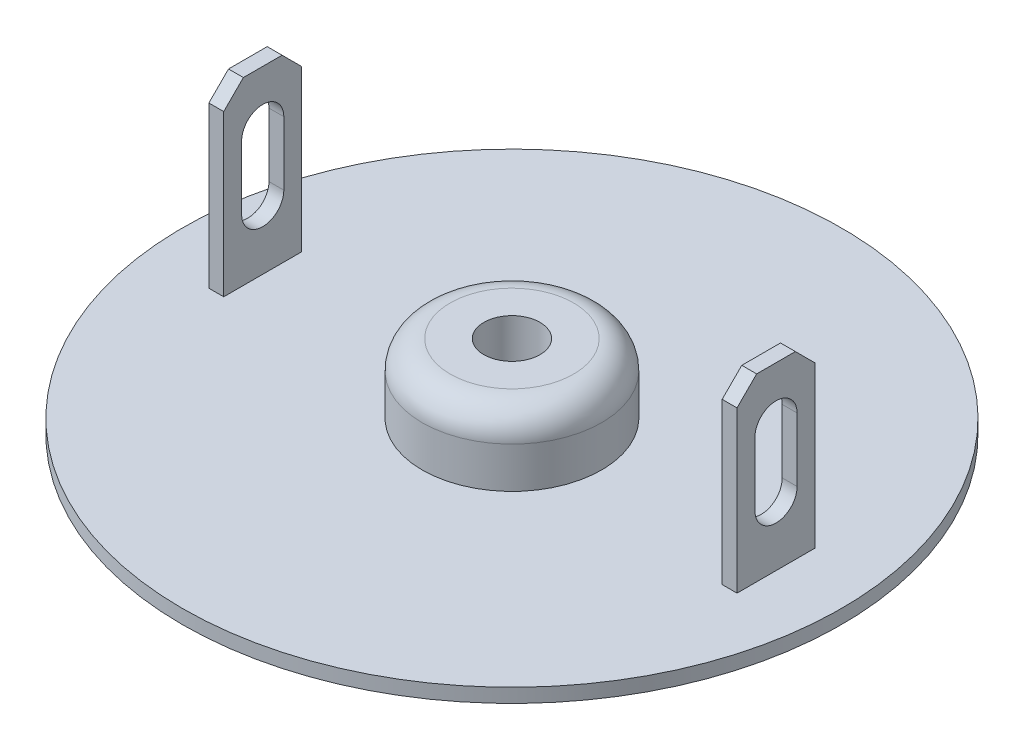
ISO-10303-21;
HEADER;
FILE_DESCRIPTION(('STEP AP214'),'2;1');
FILE_NAME('part.step','',(''),(''),'','','');
FILE_SCHEMA(('AUTOMOTIVE_DESIGN { 1 0 10303 214 1 1 1 1 }'));
ENDSEC;
DATA;
#1=APPLICATION_CONTEXT('core data for automotive mechanical design processes');
#2=APPLICATION_PROTOCOL_DEFINITION('international standard','automotive_design',2000,#1);
#3=PRODUCT_CONTEXT('',#1,'mechanical');
#4=PRODUCT('Part','Part','',(#3));
#5=PRODUCT_RELATED_PRODUCT_CATEGORY('part','',(#4));
#6=PRODUCT_DEFINITION_FORMATION('','',#4);
#7=PRODUCT_DEFINITION_CONTEXT('part definition',#1,'design');
#8=PRODUCT_DEFINITION('design','',#6,#7);
#9=PRODUCT_DEFINITION_SHAPE('','',#8);
#10=(LENGTH_UNIT() NAMED_UNIT(*) SI_UNIT(.MILLI.,.METRE.));
#11=(NAMED_UNIT(*) PLANE_ANGLE_UNIT() SI_UNIT($,.RADIAN.));
#12=(NAMED_UNIT(*) SI_UNIT($,.STERADIAN.) SOLID_ANGLE_UNIT());
#13=UNCERTAINTY_MEASURE_WITH_UNIT(LENGTH_MEASURE(1.E-05),#10,'distance_accuracy_value','');
#14=(GEOMETRIC_REPRESENTATION_CONTEXT(3) GLOBAL_UNCERTAINTY_ASSIGNED_CONTEXT((#13)) GLOBAL_UNIT_ASSIGNED_CONTEXT((#10,
#11,#12)) REPRESENTATION_CONTEXT('',''));
#15=CARTESIAN_POINT('',(0.,0.,0.));
#16=DIRECTION('',(0.,0.,1.));
#17=DIRECTION('',(1.,0.,0.));
#18=AXIS2_PLACEMENT_3D('',#15,#16,#17);
#19=CARTESIAN_POINT('',(0.,0.5,0.));
#20=DIRECTION('',(0.,1.,0.));
#21=DIRECTION('',(0.,0.,1.));
#22=AXIS2_PLACEMENT_3D('',#19,#20,#21);
#23=PLANE('',#22);
#24=DIRECTION('',(0.,0.,-1.));
#25=VECTOR('',#24,1.);
#26=CARTESIAN_POINT('',(8.885,0.5,1.39));
#27=LINE('',#26,#25);
#28=CARTESIAN_POINT('',(8.885,0.5,1.39));
#29=VERTEX_POINT('',#28);
#30=CARTESIAN_POINT('',(8.885,0.5,-1.39));
#31=VERTEX_POINT('',#30);
#32=EDGE_CURVE('E209',#29,#31,#27,.T.);
#33=ORIENTED_EDGE('',*,*,#32,.T.);
#34=DIRECTION('',(1.,0.,0.));
#35=VECTOR('',#34,1.);
#36=CARTESIAN_POINT('',(9.415,0.5,-1.39));
#37=LINE('',#36,#35);
#38=CARTESIAN_POINT('',(9.415,0.5,-1.39));
#39=VERTEX_POINT('',#38);
#40=EDGE_CURVE('E205',#31,#39,#37,.T.);
#41=ORIENTED_EDGE('',*,*,#40,.T.);
#42=DIRECTION('',(0.,0.,1.));
#43=VECTOR('',#42,1.);
#44=CARTESIAN_POINT('',(9.415,0.5,1.39));
#45=LINE('',#44,#43);
#46=CARTESIAN_POINT('',(9.415,0.5,1.39));
#47=VERTEX_POINT('',#46);
#48=EDGE_CURVE('E216',#39,#47,#45,.T.);
#49=ORIENTED_EDGE('',*,*,#48,.T.);
#50=DIRECTION('',(-1.,0.,0.));
#51=VECTOR('',#50,1.);
#52=CARTESIAN_POINT('',(9.415,0.5,1.39));
#53=LINE('',#52,#51);
#54=EDGE_CURVE('E212',#47,#29,#53,.T.);
#55=ORIENTED_EDGE('',*,*,#54,.T.);
#56=EDGE_LOOP('',(#33,#41,#49,#55));
#57=FACE_BOUND('',#56,.T.);
#58=CARTESIAN_POINT('',(0.,0.5,0.));
#59=DIRECTION('',(0.,1.,0.));
#60=DIRECTION('',(0.,0.,1.));
#61=AXIS2_PLACEMENT_3D('',#58,#59,#60);
#62=CIRCLE('',#61,3.2);
#63=CARTESIAN_POINT('',(0.,0.5,3.2));
#64=VERTEX_POINT('',#63);
#65=EDGE_CURVE('E315',#64,#64,#62,.T.);
#66=ORIENTED_EDGE('',*,*,#65,.F.);
#67=EDGE_LOOP('',(#66));
#68=FACE_BOUND('',#67,.T.);
#69=CARTESIAN_POINT('',(0.,0.5,0.));
#70=DIRECTION('',(0.,1.,0.));
#71=DIRECTION('',(0.,0.,1.));
#72=AXIS2_PLACEMENT_3D('',#69,#70,#71);
#73=CIRCLE('',#72,11.75);
#74=CARTESIAN_POINT('',(0.,0.5,11.75));
#75=VERTEX_POINT('',#74);
#76=EDGE_CURVE('E292',#75,#75,#73,.T.);
#77=ORIENTED_EDGE('',*,*,#76,.T.);
#78=EDGE_LOOP('',(#77));
#79=FACE_BOUND('',#78,.T.);
#80=DIRECTION('',(-1.,0.,0.));
#81=VECTOR('',#80,1.);
#82=CARTESIAN_POINT('',(-9.415,0.5,-1.39));
#83=LINE('',#82,#81);
#84=CARTESIAN_POINT('',(-8.885,0.5,-1.39));
#85=VERTEX_POINT('',#84);
#86=CARTESIAN_POINT('',(-9.415,0.5,-1.39));
#87=VERTEX_POINT('',#86);
#88=EDGE_CURVE('E273',#85,#87,#83,.T.);
#89=ORIENTED_EDGE('',*,*,#88,.F.);
#90=DIRECTION('',(0.,0.,-1.));
#91=VECTOR('',#90,1.);
#92=CARTESIAN_POINT('',(-8.885,0.5,1.39));
#93=LINE('',#92,#91);
#94=CARTESIAN_POINT('',(-8.885,0.5,1.39));
#95=VERTEX_POINT('',#94);
#96=EDGE_CURVE('E262',#95,#85,#93,.T.);
#97=ORIENTED_EDGE('',*,*,#96,.F.);
#98=DIRECTION('',(1.,0.,0.));
#99=VECTOR('',#98,1.);
#100=CARTESIAN_POINT('',(-9.415,0.5,1.39));
#101=LINE('',#100,#99);
#102=CARTESIAN_POINT('',(-9.415,0.5,1.39));
#103=VERTEX_POINT('',#102);
#104=EDGE_CURVE('E267',#103,#95,#101,.T.);
#105=ORIENTED_EDGE('',*,*,#104,.F.);
#106=DIRECTION('',(0.,0.,1.));
#107=VECTOR('',#106,1.);
#108=CARTESIAN_POINT('',(-9.415,0.5,1.39));
#109=LINE('',#108,#107);
#110=EDGE_CURVE('E276',#87,#103,#109,.T.);
#111=ORIENTED_EDGE('',*,*,#110,.F.);
#112=EDGE_LOOP('',(#89,#97,#105,#111));
#113=FACE_BOUND('',#112,.T.);
#114=ADVANCED_FACE('F36',(#57,#68,#79,#113),#23,.T.);
#115=CARTESIAN_POINT('',(0.,0.,0.));
#116=DIRECTION('',(0.,1.,0.));
#117=DIRECTION('',(0.,0.,1.));
#118=AXIS2_PLACEMENT_3D('',#115,#116,#117);
#119=PLANE('',#118);
#120=CARTESIAN_POINT('',(0.,0.,0.));
#121=DIRECTION('',(0.,1.,0.));
#122=DIRECTION('',(0.,0.,1.));
#123=AXIS2_PLACEMENT_3D('',#120,#121,#122);
#124=CIRCLE('',#123,11.75);
#125=CARTESIAN_POINT('',(0.,0.,11.75));
#126=VERTEX_POINT('',#125);
#127=EDGE_CURVE('E291',#126,#126,#124,.T.);
#128=ORIENTED_EDGE('',*,*,#127,.F.);
#129=EDGE_LOOP('',(#128));
#130=FACE_BOUND('',#129,.T.);
#131=CARTESIAN_POINT('',(0.,0.,0.));
#132=DIRECTION('',(0.,1.,0.));
#133=DIRECTION('',(0.,0.,1.));
#134=AXIS2_PLACEMENT_3D('',#131,#132,#133);
#135=CIRCLE('',#134,1.);
#136=CARTESIAN_POINT('',(0.,0.,1.));
#137=VERTEX_POINT('',#136);
#138=EDGE_CURVE('E288',#137,#137,#135,.T.);
#139=ORIENTED_EDGE('',*,*,#138,.T.);
#140=EDGE_LOOP('',(#139));
#141=FACE_BOUND('',#140,.T.);
#142=ADVANCED_FACE('F366',(#130,#141),#119,.F.);
#143=CARTESIAN_POINT('',(0.,0.5,0.));
#144=DIRECTION('',(0.,-1.,0.));
#145=DIRECTION('',(0.,0.,-1.));
#146=AXIS2_PLACEMENT_3D('',#143,#144,#145);
#147=CYLINDRICAL_SURFACE('',#146,11.75);
#148=ORIENTED_EDGE('',*,*,#76,.F.);
#149=EDGE_LOOP('',(#148));
#150=FACE_BOUND('',#149,.T.);
#151=ORIENTED_EDGE('',*,*,#127,.T.);
#152=EDGE_LOOP('',(#151));
#153=FACE_BOUND('',#152,.T.);
#154=ADVANCED_FACE('F472',(#150,#153),#147,.T.);
#155=CARTESIAN_POINT('',(0.,0.5,0.));
#156=DIRECTION('',(0.,-1.,0.));
#157=DIRECTION('',(0.,0.,-1.));
#158=AXIS2_PLACEMENT_3D('',#155,#156,#157);
#159=CYLINDRICAL_SURFACE('',#158,1.);
#160=ORIENTED_EDGE('',*,*,#138,.F.);
#161=EDGE_LOOP('',(#160));
#162=FACE_BOUND('',#161,.T.);
#163=CARTESIAN_POINT('',(0.,2.96,0.));
#164=DIRECTION('',(0.,1.,0.));
#165=DIRECTION('',(0.,0.,1.));
#166=AXIS2_PLACEMENT_3D('',#163,#164,#165);
#167=CIRCLE('',#166,1.);
#168=CARTESIAN_POINT('',(0.,2.96,1.));
#169=VERTEX_POINT('',#168);
#170=EDGE_CURVE('E228',#169,#169,#167,.T.);
#171=ORIENTED_EDGE('',*,*,#170,.T.);
#172=EDGE_LOOP('',(#171));
#173=FACE_BOUND('',#172,.T.);
#174=ADVANCED_FACE('F469',(#162,#173),#159,.F.);
#175=CARTESIAN_POINT('',(-8.885,6.92,1.39));
#176=DIRECTION('',(-1.,0.,0.));
#177=DIRECTION('',(0.,0.,1.));
#178=AXIS2_PLACEMENT_3D('',#175,#176,#177);
#179=PLANE('',#178);
#180=DIRECTION('',(0.,-1.,0.));
#181=VECTOR('',#180,1.);
#182=CARTESIAN_POINT('',(-8.885,4.99199234316938,0.751927556844407));
#183=LINE('',#182,#181);
#184=CARTESIAN_POINT('',(-8.885,4.99199234316938,0.751927556844407));
#185=VERTEX_POINT('',#184);
#186=CARTESIAN_POINT('',(-8.885,2.72240765217856,0.751927556844407));
#187=VERTEX_POINT('',#186);
#188=EDGE_CURVE('E233',#185,#187,#183,.T.);
#189=ORIENTED_EDGE('',*,*,#188,.F.);
#190=CARTESIAN_POINT('',(-8.885,4.99199234316938,0.));
#191=DIRECTION('',(-1.,0.,0.));
#192=DIRECTION('',(0.,0.,1.));
#193=AXIS2_PLACEMENT_3D('',#190,#191,#192);
#194=CIRCLE('',#193,0.751927556844407);
#195=CARTESIAN_POINT('',(-8.885,4.99199234316938,-0.751927556844407));
#196=VERTEX_POINT('',#195);
#197=EDGE_CURVE('E236',#196,#185,#194,.F.);
#198=ORIENTED_EDGE('',*,*,#197,.F.);
#199=DIRECTION('',(0.,1.,0.));
#200=VECTOR('',#199,1.);
#201=CARTESIAN_POINT('',(-8.885,4.99199234316938,-0.751927556844407));
#202=LINE('',#201,#200);
#203=CARTESIAN_POINT('',(-8.885,2.72240765217856,-0.751927556844407));
#204=VERTEX_POINT('',#203);
#205=EDGE_CURVE('E253',#204,#196,#202,.T.);
#206=ORIENTED_EDGE('',*,*,#205,.F.);
#207=CARTESIAN_POINT('',(-8.885,2.72240765217856,0.));
#208=DIRECTION('',(-1.,0.,0.));
#209=DIRECTION('',(0.,0.,1.));
#210=AXIS2_PLACEMENT_3D('',#207,#208,#209);
#211=CIRCLE('',#210,0.751927556844407);
#212=EDGE_CURVE('E231',#187,#204,#211,.F.);
#213=ORIENTED_EDGE('',*,*,#212,.F.);
#214=EDGE_LOOP('',(#189,#198,#206,#213));
#215=FACE_BOUND('',#214,.T.);
#216=DIRECTION('',(0.,-1.,0.));
#217=VECTOR('',#216,1.);
#218=CARTESIAN_POINT('',(-8.885,6.92,-1.39));
#219=LINE('',#218,#217);
#220=CARTESIAN_POINT('',(-8.885,6.21999999999999,-1.39));
#221=VERTEX_POINT('',#220);
#222=EDGE_CURVE('E286',#221,#85,#219,.T.);
#223=ORIENTED_EDGE('',*,*,#222,.F.);
#224=DIRECTION('',(0.,-0.707106781186549,-0.707106781186546));
#225=VECTOR('',#224,1.);
#226=CARTESIAN_POINT('',(-8.885,6.92,-0.689999999999998));
#227=LINE('',#226,#225);
#228=CARTESIAN_POINT('',(-8.885,6.92,-0.689999999999999));
#229=VERTEX_POINT('',#228);
#230=EDGE_CURVE('E311',#221,#229,#227,.F.);
#231=ORIENTED_EDGE('',*,*,#230,.T.);
#232=DIRECTION('',(0.,0.,-1.));
#233=VECTOR('',#232,1.);
#234=CARTESIAN_POINT('',(-8.885,6.92,1.39));
#235=LINE('',#234,#233);
#236=CARTESIAN_POINT('',(-8.885,6.92,0.689999999999996));
#237=VERTEX_POINT('',#236);
#238=EDGE_CURVE('E263',#237,#229,#235,.T.);
#239=ORIENTED_EDGE('',*,*,#238,.F.);
#240=DIRECTION('',(0.,0.707106781186549,-0.707106781186546));
#241=VECTOR('',#240,1.);
#242=CARTESIAN_POINT('',(-8.885,6.92,0.689999999999998));
#243=LINE('',#242,#241);
#244=CARTESIAN_POINT('',(-8.885,6.21999999999999,1.39));
#245=VERTEX_POINT('',#244);
#246=EDGE_CURVE('E309',#237,#245,#243,.F.);
#247=ORIENTED_EDGE('',*,*,#246,.T.);
#248=DIRECTION('',(0.,-1.,0.));
#249=VECTOR('',#248,1.);
#250=CARTESIAN_POINT('',(-8.885,6.92,1.39));
#251=LINE('',#250,#249);
#252=EDGE_CURVE('E270',#245,#95,#251,.T.);
#253=ORIENTED_EDGE('',*,*,#252,.T.);
#254=ORIENTED_EDGE('',*,*,#96,.T.);
#255=EDGE_LOOP('',(#223,#231,#239,#247,#253,#254));
#256=FACE_BOUND('',#255,.T.);
#257=ADVANCED_FACE('F383',(#215,#256),#179,.F.);
#258=CARTESIAN_POINT('',(-9.415,6.92,-1.39));
#259=DIRECTION('',(0.,0.,1.));
#260=DIRECTION('',(1.,0.,0.));
#261=AXIS2_PLACEMENT_3D('',#258,#259,#260);
#262=PLANE('',#261);
#263=DIRECTION('',(0.,-1.,0.));
#264=VECTOR('',#263,1.);
#265=CARTESIAN_POINT('',(-9.415,6.92,-1.39));
#266=LINE('',#265,#264);
#267=CARTESIAN_POINT('',(-9.415,6.21999999999999,-1.39));
#268=VERTEX_POINT('',#267);
#269=EDGE_CURVE('E284',#268,#87,#266,.T.);
#270=ORIENTED_EDGE('',*,*,#269,.F.);
#271=DIRECTION('',(1.,0.,0.));
#272=VECTOR('',#271,1.);
#273=CARTESIAN_POINT('',(-9.415,6.21999999999999,-1.39));
#274=LINE('',#273,#272);
#275=EDGE_CURVE('E307',#268,#221,#274,.T.);
#276=ORIENTED_EDGE('',*,*,#275,.T.);
#277=ORIENTED_EDGE('',*,*,#222,.T.);
#278=ORIENTED_EDGE('',*,*,#88,.T.);
#279=EDGE_LOOP('',(#270,#276,#277,#278));
#280=FACE_BOUND('',#279,.T.);
#281=ADVANCED_FACE('F378',(#280),#262,.F.);
#282=CARTESIAN_POINT('',(-9.415,6.92,1.39));
#283=DIRECTION('',(1.,0.,0.));
#284=DIRECTION('',(0.,0.,-1.));
#285=AXIS2_PLACEMENT_3D('',#282,#283,#284);
#286=PLANE('',#285);
#287=DIRECTION('',(0.,-1.,0.));
#288=VECTOR('',#287,1.);
#289=CARTESIAN_POINT('',(-9.415,4.99199234316938,-0.751927556844407));
#290=LINE('',#289,#288);
#291=CARTESIAN_POINT('',(-9.415,4.99199234316938,-0.751927556844407));
#292=VERTEX_POINT('',#291);
#293=CARTESIAN_POINT('',(-9.415,2.72240765217856,-0.751927556844407));
#294=VERTEX_POINT('',#293);
#295=EDGE_CURVE('E241',#292,#294,#290,.T.);
#296=ORIENTED_EDGE('',*,*,#295,.F.);
#297=CARTESIAN_POINT('',(-9.415,4.99199234316938,0.));
#298=DIRECTION('',(-1.,0.,0.));
#299=DIRECTION('',(0.,0.,1.));
#300=AXIS2_PLACEMENT_3D('',#297,#298,#299);
#301=CIRCLE('',#300,0.751927556844407);
#302=CARTESIAN_POINT('',(-9.415,4.99199234316938,0.751927556844407));
#303=VERTEX_POINT('',#302);
#304=EDGE_CURVE('E239',#303,#292,#301,.T.);
#305=ORIENTED_EDGE('',*,*,#304,.F.);
#306=DIRECTION('',(0.,1.,0.));
#307=VECTOR('',#306,1.);
#308=CARTESIAN_POINT('',(-9.415,4.99199234316938,0.751927556844407));
#309=LINE('',#308,#307);
#310=CARTESIAN_POINT('',(-9.415,2.72240765217856,0.751927556844407));
#311=VERTEX_POINT('',#310);
#312=EDGE_CURVE('E247',#311,#303,#309,.T.);
#313=ORIENTED_EDGE('',*,*,#312,.F.);
#314=CARTESIAN_POINT('',(-9.415,2.72240765217856,0.));
#315=DIRECTION('',(-1.,0.,0.));
#316=DIRECTION('',(0.,0.,1.));
#317=AXIS2_PLACEMENT_3D('',#314,#315,#316);
#318=CIRCLE('',#317,0.751927556844407);
#319=EDGE_CURVE('E244',#294,#311,#318,.T.);
#320=ORIENTED_EDGE('',*,*,#319,.F.);
#321=EDGE_LOOP('',(#296,#305,#313,#320));
#322=FACE_BOUND('',#321,.T.);
#323=DIRECTION('',(0.,0.,1.));
#324=VECTOR('',#323,1.);
#325=CARTESIAN_POINT('',(-9.415,6.92,1.39));
#326=LINE('',#325,#324);
#327=CARTESIAN_POINT('',(-9.415,6.92,-0.69));
#328=VERTEX_POINT('',#327);
#329=CARTESIAN_POINT('',(-9.415,6.92,0.689999999999996));
#330=VERTEX_POINT('',#329);
#331=EDGE_CURVE('E266',#328,#330,#326,.T.);
#332=ORIENTED_EDGE('',*,*,#331,.F.);
#333=DIRECTION('',(0.,0.707106781186549,0.707106781186546));
#334=VECTOR('',#333,1.);
#335=CARTESIAN_POINT('',(-9.415,6.92,-0.689999999999998));
#336=LINE('',#335,#334);
#337=EDGE_CURVE('E305',#328,#268,#336,.F.);
#338=ORIENTED_EDGE('',*,*,#337,.T.);
#339=ORIENTED_EDGE('',*,*,#269,.T.);
#340=ORIENTED_EDGE('',*,*,#110,.T.);
#341=DIRECTION('',(0.,-1.,0.));
#342=VECTOR('',#341,1.);
#343=CARTESIAN_POINT('',(-9.415,6.92,1.39));
#344=LINE('',#343,#342);
#345=CARTESIAN_POINT('',(-9.415,6.21999999999999,1.39));
#346=VERTEX_POINT('',#345);
#347=EDGE_CURVE('E282',#346,#103,#344,.T.);
#348=ORIENTED_EDGE('',*,*,#347,.F.);
#349=DIRECTION('',(0.,-0.707106781186549,0.707106781186546));
#350=VECTOR('',#349,1.);
#351=CARTESIAN_POINT('',(-9.415,6.92,0.689999999999998));
#352=LINE('',#351,#350);
#353=EDGE_CURVE('E303',#346,#330,#352,.F.);
#354=ORIENTED_EDGE('',*,*,#353,.T.);
#355=EDGE_LOOP('',(#332,#338,#339,#340,#348,#354));
#356=FACE_BOUND('',#355,.T.);
#357=ADVANCED_FACE('F393',(#322,#356),#286,.F.);
#358=CARTESIAN_POINT('',(-9.415,6.92,1.39));
#359=DIRECTION('',(0.,0.,-1.));
#360=DIRECTION('',(-1.,0.,0.));
#361=AXIS2_PLACEMENT_3D('',#358,#359,#360);
#362=PLANE('',#361);
#363=ORIENTED_EDGE('',*,*,#252,.F.);
#364=DIRECTION('',(-1.,0.,0.));
#365=VECTOR('',#364,1.);
#366=CARTESIAN_POINT('',(-9.415,6.21999999999999,1.39));
#367=LINE('',#366,#365);
#368=EDGE_CURVE('E313',#245,#346,#367,.T.);
#369=ORIENTED_EDGE('',*,*,#368,.T.);
#370=ORIENTED_EDGE('',*,*,#347,.T.);
#371=ORIENTED_EDGE('',*,*,#104,.T.);
#372=EDGE_LOOP('',(#363,#369,#370,#371));
#373=FACE_BOUND('',#372,.T.);
#374=ADVANCED_FACE('F388',(#373),#362,.F.);
#375=CARTESIAN_POINT('',(0.,6.92,0.));
#376=DIRECTION('',(0.,-1.,0.));
#377=DIRECTION('',(0.,0.,-1.));
#378=AXIS2_PLACEMENT_3D('',#375,#376,#377);
#379=PLANE('',#378);
#380=ORIENTED_EDGE('',*,*,#238,.T.);
#381=DIRECTION('',(-1.,0.,0.));
#382=VECTOR('',#381,1.);
#383=CARTESIAN_POINT('',(0.,6.92,-0.689999999999996));
#384=LINE('',#383,#382);
#385=EDGE_CURVE('E300',#229,#328,#384,.T.);
#386=ORIENTED_EDGE('',*,*,#385,.T.);
#387=ORIENTED_EDGE('',*,*,#331,.T.);
#388=DIRECTION('',(1.,0.,0.));
#389=VECTOR('',#388,1.);
#390=CARTESIAN_POINT('',(0.,6.92,0.69));
#391=LINE('',#390,#389);
#392=EDGE_CURVE('E295',#330,#237,#391,.T.);
#393=ORIENTED_EDGE('',*,*,#392,.T.);
#394=EDGE_LOOP('',(#380,#386,#387,#393));
#395=FACE_BOUND('',#394,.T.);
#396=ADVANCED_FACE('F398',(#395),#379,.F.);
#397=CARTESIAN_POINT('',(0.,6.92,-0.689999999999996));
#398=DIRECTION('',(0.,-0.707106781186546,0.707106781186549));
#399=DIRECTION('',(-1.,0.,0.));
#400=AXIS2_PLACEMENT_3D('',#397,#398,#399);
#401=PLANE('',#400);
#402=ORIENTED_EDGE('',*,*,#230,.F.);
#403=ORIENTED_EDGE('',*,*,#275,.F.);
#404=ORIENTED_EDGE('',*,*,#337,.F.);
#405=ORIENTED_EDGE('',*,*,#385,.F.);
#406=EDGE_LOOP('',(#402,#403,#404,#405));
#407=FACE_BOUND('',#406,.T.);
#408=ADVANCED_FACE('F396',(#407),#401,.F.);
#409=CARTESIAN_POINT('',(0.,6.92,0.69));
#410=DIRECTION('',(0.,-0.707106781186546,-0.707106781186549));
#411=DIRECTION('',(1.,0.,0.));
#412=AXIS2_PLACEMENT_3D('',#409,#410,#411);
#413=PLANE('',#412);
#414=ORIENTED_EDGE('',*,*,#353,.F.);
#415=ORIENTED_EDGE('',*,*,#368,.F.);
#416=ORIENTED_EDGE('',*,*,#246,.F.);
#417=ORIENTED_EDGE('',*,*,#392,.F.);
#418=EDGE_LOOP('',(#414,#415,#416,#417));
#419=FACE_BOUND('',#418,.T.);
#420=ADVANCED_FACE('F401',(#419),#413,.F.);
#421=CARTESIAN_POINT('',(11.751,4.99199234316938,0.));
#422=DIRECTION('',(-1.,0.,0.));
#423=DIRECTION('',(0.,0.,1.));
#424=AXIS2_PLACEMENT_3D('',#421,#422,#423);
#425=CYLINDRICAL_SURFACE('',#424,0.751927556844407);
#426=ORIENTED_EDGE('',*,*,#197,.T.);
#427=DIRECTION('',(-1.,0.,0.));
#428=VECTOR('',#427,1.);
#429=CARTESIAN_POINT('',(11.751,4.99199234316938,0.751927556844407));
#430=LINE('',#429,#428);
#431=EDGE_CURVE('E251',#185,#303,#430,.T.);
#432=ORIENTED_EDGE('',*,*,#431,.T.);
#433=ORIENTED_EDGE('',*,*,#304,.T.);
#434=DIRECTION('',(-1.,0.,0.));
#435=VECTOR('',#434,1.);
#436=CARTESIAN_POINT('',(11.751,4.99199234316938,-0.751927556844407));
#437=LINE('',#436,#435);
#438=EDGE_CURVE('E250',#196,#292,#437,.T.);
#439=ORIENTED_EDGE('',*,*,#438,.F.);
#440=EDGE_LOOP('',(#426,#432,#433,#439));
#441=FACE_BOUND('',#440,.T.);
#442=ADVANCED_FACE('F403',(#441),#425,.F.);
#443=CARTESIAN_POINT('',(11.751,4.99199234316938,0.751927556844407));
#444=DIRECTION('',(0.,0.,1.));
#445=DIRECTION('',(1.,0.,0.));
#446=AXIS2_PLACEMENT_3D('',#443,#444,#445);
#447=PLANE('',#446);
#448=ORIENTED_EDGE('',*,*,#188,.T.);
#449=DIRECTION('',(-1.,0.,0.));
#450=VECTOR('',#449,1.);
#451=CARTESIAN_POINT('',(11.751,2.72240765217856,0.751927556844407));
#452=LINE('',#451,#450);
#453=EDGE_CURVE('E254',#187,#311,#452,.T.);
#454=ORIENTED_EDGE('',*,*,#453,.T.);
#455=ORIENTED_EDGE('',*,*,#312,.T.);
#456=ORIENTED_EDGE('',*,*,#431,.F.);
#457=EDGE_LOOP('',(#448,#454,#455,#456));
#458=FACE_BOUND('',#457,.T.);
#459=ADVANCED_FACE('F409',(#458),#447,.F.);
#460=CARTESIAN_POINT('',(11.751,2.72240765217856,0.));
#461=DIRECTION('',(-1.,0.,0.));
#462=DIRECTION('',(0.,0.,1.));
#463=AXIS2_PLACEMENT_3D('',#460,#461,#462);
#464=CYLINDRICAL_SURFACE('',#463,0.751927556844407);
#465=ORIENTED_EDGE('',*,*,#212,.T.);
#466=DIRECTION('',(-1.,0.,0.));
#467=VECTOR('',#466,1.);
#468=CARTESIAN_POINT('',(11.751,2.72240765217856,-0.751927556844407));
#469=LINE('',#468,#467);
#470=EDGE_CURVE('E256',#204,#294,#469,.T.);
#471=ORIENTED_EDGE('',*,*,#470,.T.);
#472=ORIENTED_EDGE('',*,*,#319,.T.);
#473=ORIENTED_EDGE('',*,*,#453,.F.);
#474=EDGE_LOOP('',(#465,#471,#472,#473));
#475=FACE_BOUND('',#474,.T.);
#476=ADVANCED_FACE('F450',(#475),#464,.F.);
#477=CARTESIAN_POINT('',(11.751,4.99199234316938,-0.751927556844407));
#478=DIRECTION('',(0.,0.,-1.));
#479=DIRECTION('',(-1.,0.,0.));
#480=AXIS2_PLACEMENT_3D('',#477,#478,#479);
#481=PLANE('',#480);
#482=ORIENTED_EDGE('',*,*,#205,.T.);
#483=ORIENTED_EDGE('',*,*,#438,.T.);
#484=ORIENTED_EDGE('',*,*,#295,.T.);
#485=ORIENTED_EDGE('',*,*,#470,.F.);
#486=EDGE_LOOP('',(#482,#483,#484,#485));
#487=FACE_BOUND('',#486,.T.);
#488=ADVANCED_FACE('F446',(#487),#481,.F.);
#489=CARTESIAN_POINT('',(-1.,2.96,0.));
#490=DIRECTION('',(0.,1.,0.));
#491=DIRECTION('',(0.,0.,1.));
#492=AXIS2_PLACEMENT_3D('',#489,#490,#491);
#493=PLANE('',#492);
#494=CARTESIAN_POINT('',(0.,2.96,0.));
#495=DIRECTION('',(0.,1.,0.));
#496=DIRECTION('',(0.,0.,1.));
#497=AXIS2_PLACEMENT_3D('',#494,#495,#496);
#498=CIRCLE('',#497,2.2);
#499=CARTESIAN_POINT('',(0.,2.96,2.2));
#500=VERTEX_POINT('',#499);
#501=EDGE_CURVE('E318',#500,#500,#498,.T.);
#502=ORIENTED_EDGE('',*,*,#501,.T.);
#503=EDGE_LOOP('',(#502));
#504=FACE_BOUND('',#503,.T.);
#505=ORIENTED_EDGE('',*,*,#170,.F.);
#506=EDGE_LOOP('',(#505));
#507=FACE_BOUND('',#506,.T.);
#508=ADVANCED_FACE('F442',(#504,#507),#493,.T.);
#509=CARTESIAN_POINT('',(0.,3.49567618902772,0.));
#510=DIRECTION('',(0.,1.,0.));
#511=DIRECTION('',(0.,0.,1.));
#512=AXIS2_PLACEMENT_3D('',#509,#510,#511);
#513=CYLINDRICAL_SURFACE('',#512,3.2);
#514=CARTESIAN_POINT('',(0.,1.96,0.));
#515=DIRECTION('',(0.,1.,0.));
#516=DIRECTION('',(0.,0.,1.));
#517=AXIS2_PLACEMENT_3D('',#514,#515,#516);
#518=CIRCLE('',#517,3.2);
#519=CARTESIAN_POINT('',(0.,1.96,3.2));
#520=VERTEX_POINT('',#519);
#521=EDGE_CURVE('E321',#520,#520,#518,.F.);
#522=ORIENTED_EDGE('',*,*,#521,.T.);
#523=EDGE_LOOP('',(#522));
#524=FACE_BOUND('',#523,.T.);
#525=ORIENTED_EDGE('',*,*,#65,.T.);
#526=EDGE_LOOP('',(#525));
#527=FACE_BOUND('',#526,.T.);
#528=ADVANCED_FACE('F417',(#524,#527),#513,.T.);
#529=CARTESIAN_POINT('',(0.,1.96,0.));
#530=DIRECTION('',(0.,1.,0.));
#531=DIRECTION('',(0.,0.,1.));
#532=AXIS2_PLACEMENT_3D('',#529,#530,#531);
#533=TOROIDAL_SURFACE('',#532,2.2,1.);
#534=ORIENTED_EDGE('',*,*,#521,.F.);
#535=EDGE_LOOP('',(#534));
#536=FACE_BOUND('',#535,.T.);
#537=ORIENTED_EDGE('',*,*,#501,.F.);
#538=EDGE_LOOP('',(#537));
#539=FACE_BOUND('',#538,.T.);
#540=ADVANCED_FACE('F415',(#536,#539),#533,.T.);
#541=CARTESIAN_POINT('',(8.885,6.92,1.39));
#542=DIRECTION('',(-1.,0.,0.));
#543=DIRECTION('',(0.,0.,1.));
#544=AXIS2_PLACEMENT_3D('',#541,#542,#543);
#545=PLANE('',#544);
#546=CARTESIAN_POINT('',(8.885,4.99199234316938,0.));
#547=DIRECTION('',(-1.,0.,0.));
#548=DIRECTION('',(0.,0.,1.));
#549=AXIS2_PLACEMENT_3D('',#546,#547,#548);
#550=CIRCLE('',#549,0.751927556844407);
#551=CARTESIAN_POINT('',(8.885,4.99199234316938,0.751927556844407));
#552=VERTEX_POINT('',#551);
#553=CARTESIAN_POINT('',(8.885,4.99199234316938,-0.751927556844407));
#554=VERTEX_POINT('',#553);
#555=EDGE_CURVE('E183',#552,#554,#550,.T.);
#556=ORIENTED_EDGE('',*,*,#555,.F.);
#557=DIRECTION('',(0.,1.,0.));
#558=VECTOR('',#557,1.);
#559=CARTESIAN_POINT('',(8.885,4.99199234316938,0.751927556844407));
#560=LINE('',#559,#558);
#561=CARTESIAN_POINT('',(8.885,2.72240765217856,0.751927556844407));
#562=VERTEX_POINT('',#561);
#563=EDGE_CURVE('E51',#562,#552,#560,.T.);
#564=ORIENTED_EDGE('',*,*,#563,.F.);
#565=CARTESIAN_POINT('',(8.885,2.72240765217856,0.));
#566=DIRECTION('',(-1.,0.,0.));
#567=DIRECTION('',(0.,0.,1.));
#568=AXIS2_PLACEMENT_3D('',#565,#566,#567);
#569=CIRCLE('',#568,0.751927556844407);
#570=CARTESIAN_POINT('',(8.885,2.72240765217856,-0.751927556844407));
#571=VERTEX_POINT('',#570);
#572=EDGE_CURVE('E191',#571,#562,#569,.T.);
#573=ORIENTED_EDGE('',*,*,#572,.F.);
#574=DIRECTION('',(0.,-1.,0.));
#575=VECTOR('',#574,1.);
#576=CARTESIAN_POINT('',(8.885,4.99199234316938,-0.751927556844407));
#577=LINE('',#576,#575);
#578=EDGE_CURVE('E175',#554,#571,#577,.T.);
#579=ORIENTED_EDGE('',*,*,#578,.F.);
#580=EDGE_LOOP('',(#556,#564,#573,#579));
#581=FACE_BOUND('',#580,.T.);
#582=DIRECTION('',(0.,0.,-1.));
#583=VECTOR('',#582,1.);
#584=CARTESIAN_POINT('',(8.885,6.92,1.39));
#585=LINE('',#584,#583);
#586=CARTESIAN_POINT('',(8.885,6.92,0.689999999999996));
#587=VERTEX_POINT('',#586);
#588=CARTESIAN_POINT('',(8.885,6.92,-0.689999999999999));
#589=VERTEX_POINT('',#588);
#590=EDGE_CURVE('E201',#587,#589,#585,.T.);
#591=ORIENTED_EDGE('',*,*,#590,.T.);
#592=DIRECTION('',(0.,-0.707106781186549,-0.707106781186546));
#593=VECTOR('',#592,1.);
#594=CARTESIAN_POINT('',(8.885,7.96,0.349999999999994));
#595=LINE('',#594,#593);
#596=CARTESIAN_POINT('',(8.885,6.21999999999999,-1.39));
#597=VERTEX_POINT('',#596);
#598=EDGE_CURVE('E44',#589,#597,#595,.T.);
#599=ORIENTED_EDGE('',*,*,#598,.T.);
#600=DIRECTION('',(0.,-1.,0.));
#601=VECTOR('',#600,1.);
#602=CARTESIAN_POINT('',(8.885,6.92,-1.39));
#603=LINE('',#602,#601);
#604=EDGE_CURVE('E208',#597,#31,#603,.T.);
#605=ORIENTED_EDGE('',*,*,#604,.T.);
#606=ORIENTED_EDGE('',*,*,#32,.F.);
#607=DIRECTION('',(0.,-1.,0.));
#608=VECTOR('',#607,1.);
#609=CARTESIAN_POINT('',(8.885,6.92,1.39));
#610=LINE('',#609,#608);
#611=CARTESIAN_POINT('',(8.885,6.21999999999999,1.39));
#612=VERTEX_POINT('',#611);
#613=EDGE_CURVE('E226',#612,#29,#610,.T.);
#614=ORIENTED_EDGE('',*,*,#613,.F.);
#615=DIRECTION('',(0.,0.707106781186549,-0.707106781186546));
#616=VECTOR('',#615,1.);
#617=CARTESIAN_POINT('',(8.885,6.57,1.04));
#618=LINE('',#617,#616);
#619=EDGE_CURVE('E335',#612,#587,#618,.T.);
#620=ORIENTED_EDGE('',*,*,#619,.T.);
#621=EDGE_LOOP('',(#591,#599,#605,#606,#614,#620));
#622=FACE_BOUND('',#621,.T.);
#623=ADVANCED_FACE('F188',(#581,#622),#545,.T.);
#624=CARTESIAN_POINT('',(9.415,6.92,1.39));
#625=DIRECTION('',(0.,0.,1.));
#626=DIRECTION('',(1.,0.,0.));
#627=AXIS2_PLACEMENT_3D('',#624,#625,#626);
#628=PLANE('',#627);
#629=DIRECTION('',(0.,-1.,0.));
#630=VECTOR('',#629,1.);
#631=CARTESIAN_POINT('',(9.415,6.92,1.39));
#632=LINE('',#631,#630);
#633=CARTESIAN_POINT('',(9.415,6.21999999999999,1.39));
#634=VERTEX_POINT('',#633);
#635=EDGE_CURVE('E224',#634,#47,#632,.T.);
#636=ORIENTED_EDGE('',*,*,#635,.F.);
#637=DIRECTION('',(-1.,0.,0.));
#638=VECTOR('',#637,1.);
#639=CARTESIAN_POINT('',(8.885,6.21999999999999,1.39));
#640=LINE('',#639,#638);
#641=EDGE_CURVE('E11',#634,#612,#640,.T.);
#642=ORIENTED_EDGE('',*,*,#641,.T.);
#643=ORIENTED_EDGE('',*,*,#613,.T.);
#644=ORIENTED_EDGE('',*,*,#54,.F.);
#645=EDGE_LOOP('',(#636,#642,#643,#644));
#646=FACE_BOUND('',#645,.T.);
#647=ADVANCED_FACE('F361',(#646),#628,.T.);
#648=CARTESIAN_POINT('',(9.415,6.92,1.39));
#649=DIRECTION('',(1.,0.,0.));
#650=DIRECTION('',(0.,0.,-1.));
#651=AXIS2_PLACEMENT_3D('',#648,#649,#650);
#652=PLANE('',#651);
#653=CARTESIAN_POINT('',(9.415,2.72240765217856,0.));
#654=DIRECTION('',(-1.,0.,0.));
#655=DIRECTION('',(0.,0.,1.));
#656=AXIS2_PLACEMENT_3D('',#653,#654,#655);
#657=CIRCLE('',#656,0.751927556844407);
#658=CARTESIAN_POINT('',(9.415,2.72240765217856,-0.751927556844407));
#659=VERTEX_POINT('',#658);
#660=CARTESIAN_POINT('',(9.415,2.72240765217856,0.751927556844407));
#661=VERTEX_POINT('',#660);
#662=EDGE_CURVE('E180',#659,#661,#657,.T.);
#663=ORIENTED_EDGE('',*,*,#662,.T.);
#664=DIRECTION('',(0.,1.,0.));
#665=VECTOR('',#664,1.);
#666=CARTESIAN_POINT('',(9.415,4.99199234316938,0.751927556844407));
#667=LINE('',#666,#665);
#668=CARTESIAN_POINT('',(9.415,4.99199234316938,0.751927556844407));
#669=VERTEX_POINT('',#668);
#670=EDGE_CURVE('E199',#661,#669,#667,.T.);
#671=ORIENTED_EDGE('',*,*,#670,.T.);
#672=CARTESIAN_POINT('',(9.415,4.99199234316938,0.));
#673=DIRECTION('',(-1.,0.,0.));
#674=DIRECTION('',(0.,0.,1.));
#675=AXIS2_PLACEMENT_3D('',#672,#673,#674);
#676=CIRCLE('',#675,0.751927556844407);
#677=CARTESIAN_POINT('',(9.415,4.99199234316938,-0.751927556844407));
#678=VERTEX_POINT('',#677);
#679=EDGE_CURVE('E213',#669,#678,#676,.T.);
#680=ORIENTED_EDGE('',*,*,#679,.T.);
#681=DIRECTION('',(0.,-1.,0.));
#682=VECTOR('',#681,1.);
#683=CARTESIAN_POINT('',(9.415,4.99199234316938,-0.751927556844407));
#684=LINE('',#683,#682);
#685=EDGE_CURVE('E59',#678,#659,#684,.T.);
#686=ORIENTED_EDGE('',*,*,#685,.T.);
#687=EDGE_LOOP('',(#663,#671,#680,#686));
#688=FACE_BOUND('',#687,.T.);
#689=DIRECTION('',(0.,-1.,0.));
#690=VECTOR('',#689,1.);
#691=CARTESIAN_POINT('',(9.415,6.92,-1.39));
#692=LINE('',#691,#690);
#693=CARTESIAN_POINT('',(9.415,6.21999999999999,-1.39));
#694=VERTEX_POINT('',#693);
#695=EDGE_CURVE('E222',#694,#39,#692,.T.);
#696=ORIENTED_EDGE('',*,*,#695,.F.);
#697=DIRECTION('',(0.,0.707106781186549,0.707106781186546));
#698=VECTOR('',#697,1.);
#699=CARTESIAN_POINT('',(9.415,7.96,0.349999999999994));
#700=LINE('',#699,#698);
#701=CARTESIAN_POINT('',(9.415,6.92,-0.69));
#702=VERTEX_POINT('',#701);
#703=EDGE_CURVE('E329',#694,#702,#700,.T.);
#704=ORIENTED_EDGE('',*,*,#703,.T.);
#705=DIRECTION('',(0.,0.,1.));
#706=VECTOR('',#705,1.);
#707=CARTESIAN_POINT('',(9.415,6.92,1.39));
#708=LINE('',#707,#706);
#709=CARTESIAN_POINT('',(9.415,6.92,0.689999999999996));
#710=VERTEX_POINT('',#709);
#711=EDGE_CURVE('E204',#702,#710,#708,.T.);
#712=ORIENTED_EDGE('',*,*,#711,.T.);
#713=DIRECTION('',(0.,-0.707106781186549,0.707106781186546));
#714=VECTOR('',#713,1.);
#715=CARTESIAN_POINT('',(9.415,6.57,1.03999999999999));
#716=LINE('',#715,#714);
#717=EDGE_CURVE('E327',#710,#634,#716,.T.);
#718=ORIENTED_EDGE('',*,*,#717,.T.);
#719=ORIENTED_EDGE('',*,*,#635,.T.);
#720=ORIENTED_EDGE('',*,*,#48,.F.);
#721=EDGE_LOOP('',(#696,#704,#712,#718,#719,#720));
#722=FACE_BOUND('',#721,.T.);
#723=ADVANCED_FACE('F350',(#688,#722),#652,.T.);
#724=CARTESIAN_POINT('',(9.415,6.92,-1.39));
#725=DIRECTION('',(0.,0.,-1.));
#726=DIRECTION('',(-1.,0.,0.));
#727=AXIS2_PLACEMENT_3D('',#724,#725,#726);
#728=PLANE('',#727);
#729=ORIENTED_EDGE('',*,*,#604,.F.);
#730=DIRECTION('',(1.,0.,0.));
#731=VECTOR('',#730,1.);
#732=CARTESIAN_POINT('',(9.415,6.21999999999999,-1.39));
#733=LINE('',#732,#731);
#734=EDGE_CURVE('E324',#597,#694,#733,.T.);
#735=ORIENTED_EDGE('',*,*,#734,.T.);
#736=ORIENTED_EDGE('',*,*,#695,.T.);
#737=ORIENTED_EDGE('',*,*,#40,.F.);
#738=EDGE_LOOP('',(#729,#735,#736,#737));
#739=FACE_BOUND('',#738,.T.);
#740=ADVANCED_FACE('F345',(#739),#728,.T.);
#741=CARTESIAN_POINT('',(0.,6.92,0.));
#742=DIRECTION('',(0.,-1.,0.));
#743=DIRECTION('',(0.,0.,-1.));
#744=AXIS2_PLACEMENT_3D('',#741,#742,#743);
#745=PLANE('',#744);
#746=ORIENTED_EDGE('',*,*,#711,.F.);
#747=DIRECTION('',(-1.,0.,0.));
#748=VECTOR('',#747,1.);
#749=CARTESIAN_POINT('',(8.885,6.92,-0.689999999999999));
#750=LINE('',#749,#748);
#751=EDGE_CURVE('E333',#702,#589,#750,.T.);
#752=ORIENTED_EDGE('',*,*,#751,.T.);
#753=ORIENTED_EDGE('',*,*,#590,.F.);
#754=DIRECTION('',(1.,0.,0.));
#755=VECTOR('',#754,1.);
#756=CARTESIAN_POINT('',(9.415,6.92,0.689999999999996));
#757=LINE('',#756,#755);
#758=EDGE_CURVE('E331',#587,#710,#757,.T.);
#759=ORIENTED_EDGE('',*,*,#758,.T.);
#760=EDGE_LOOP('',(#746,#752,#753,#759));
#761=FACE_BOUND('',#760,.T.);
#762=ADVANCED_FACE('F354',(#761),#745,.F.);
#763=CARTESIAN_POINT('',(9.415,6.21999999999999,-1.39));
#764=DIRECTION('',(0.,0.707106781186546,-0.707106781186549));
#765=DIRECTION('',(-1.,0.,0.));
#766=AXIS2_PLACEMENT_3D('',#763,#764,#765);
#767=PLANE('',#766);
#768=ORIENTED_EDGE('',*,*,#598,.F.);
#769=ORIENTED_EDGE('',*,*,#751,.F.);
#770=ORIENTED_EDGE('',*,*,#703,.F.);
#771=ORIENTED_EDGE('',*,*,#734,.F.);
#772=EDGE_LOOP('',(#768,#769,#770,#771));
#773=FACE_BOUND('',#772,.T.);
#774=ADVANCED_FACE('F347',(#773),#767,.T.);
#775=CARTESIAN_POINT('',(9.415,6.21999999999999,1.39));
#776=DIRECTION('',(0.,0.707106781186546,0.707106781186549));
#777=DIRECTION('',(1.,0.,0.));
#778=AXIS2_PLACEMENT_3D('',#775,#776,#777);
#779=PLANE('',#778);
#780=ORIENTED_EDGE('',*,*,#717,.F.);
#781=ORIENTED_EDGE('',*,*,#758,.F.);
#782=ORIENTED_EDGE('',*,*,#619,.F.);
#783=ORIENTED_EDGE('',*,*,#641,.F.);
#784=EDGE_LOOP('',(#780,#781,#782,#783));
#785=FACE_BOUND('',#784,.T.);
#786=ADVANCED_FACE('F38',(#785),#779,.T.);
#787=CARTESIAN_POINT('',(-11.751,4.99199234316938,0.751927556844407));
#788=DIRECTION('',(0.,0.,-1.));
#789=DIRECTION('',(-1.,0.,0.));
#790=AXIS2_PLACEMENT_3D('',#787,#788,#789);
#791=PLANE('',#790);
#792=ORIENTED_EDGE('',*,*,#563,.T.);
#793=DIRECTION('',(1.,0.,0.));
#794=VECTOR('',#793,1.);
#795=CARTESIAN_POINT('',(-11.751,4.99199234316938,0.751927556844407));
#796=LINE('',#795,#794);
#797=EDGE_CURVE('E185',#552,#669,#796,.T.);
#798=ORIENTED_EDGE('',*,*,#797,.T.);
#799=ORIENTED_EDGE('',*,*,#670,.F.);
#800=DIRECTION('',(1.,0.,0.));
#801=VECTOR('',#800,1.);
#802=CARTESIAN_POINT('',(-11.751,2.72240765217856,0.751927556844407));
#803=LINE('',#802,#801);
#804=EDGE_CURVE('E193',#562,#661,#803,.T.);
#805=ORIENTED_EDGE('',*,*,#804,.F.);
#806=EDGE_LOOP('',(#792,#798,#799,#805));
#807=FACE_BOUND('',#806,.T.);
#808=ADVANCED_FACE('F424',(#807),#791,.T.);
#809=CARTESIAN_POINT('',(-11.751,2.72240765217856,0.));
#810=DIRECTION('',(1.,0.,0.));
#811=DIRECTION('',(0.,0.,-1.));
#812=AXIS2_PLACEMENT_3D('',#809,#810,#811);
#813=CYLINDRICAL_SURFACE('',#812,0.751927556844407);
#814=ORIENTED_EDGE('',*,*,#572,.T.);
#815=ORIENTED_EDGE('',*,*,#804,.T.);
#816=ORIENTED_EDGE('',*,*,#662,.F.);
#817=DIRECTION('',(1.,0.,0.));
#818=VECTOR('',#817,1.);
#819=CARTESIAN_POINT('',(-11.751,2.72240765217856,-0.751927556844407));
#820=LINE('',#819,#818);
#821=EDGE_CURVE('E197',#571,#659,#820,.T.);
#822=ORIENTED_EDGE('',*,*,#821,.F.);
#823=EDGE_LOOP('',(#814,#815,#816,#822));
#824=FACE_BOUND('',#823,.T.);
#825=ADVANCED_FACE('F607',(#824),#813,.F.);
#826=CARTESIAN_POINT('',(-11.751,4.99199234316938,-0.751927556844407));
#827=DIRECTION('',(0.,0.,1.));
#828=DIRECTION('',(1.,0.,0.));
#829=AXIS2_PLACEMENT_3D('',#826,#827,#828);
#830=PLANE('',#829);
#831=ORIENTED_EDGE('',*,*,#578,.T.);
#832=ORIENTED_EDGE('',*,*,#821,.T.);
#833=ORIENTED_EDGE('',*,*,#685,.F.);
#834=DIRECTION('',(1.,0.,0.));
#835=VECTOR('',#834,1.);
#836=CARTESIAN_POINT('',(-11.751,4.99199234316938,-0.751927556844407));
#837=LINE('',#836,#835);
#838=EDGE_CURVE('E171',#554,#678,#837,.T.);
#839=ORIENTED_EDGE('',*,*,#838,.F.);
#840=EDGE_LOOP('',(#831,#832,#833,#839));
#841=FACE_BOUND('',#840,.T.);
#842=ADVANCED_FACE('F173',(#841),#830,.T.);
#843=CARTESIAN_POINT('',(-11.751,4.99199234316938,0.));
#844=DIRECTION('',(1.,0.,0.));
#845=DIRECTION('',(0.,0.,-1.));
#846=AXIS2_PLACEMENT_3D('',#843,#844,#845);
#847=CYLINDRICAL_SURFACE('',#846,0.751927556844407);
#848=ORIENTED_EDGE('',*,*,#555,.T.);
#849=ORIENTED_EDGE('',*,*,#838,.T.);
#850=ORIENTED_EDGE('',*,*,#679,.F.);
#851=ORIENTED_EDGE('',*,*,#797,.F.);
#852=EDGE_LOOP('',(#848,#849,#850,#851));
#853=FACE_BOUND('',#852,.T.);
#854=ADVANCED_FACE('F184',(#853),#847,.F.);
#855=CLOSED_SHELL('',(#114,#142,#154,#174,#257,#281,#357,#374,#396,#408,#420,#442,#459,#476,
#488,#508,#528,#540,#623,#647,#723,#740,#762,#774,#786,#808,#825,#842,#854));
#856=MANIFOLD_SOLID_BREP('B2',#855);
#857=ADVANCED_BREP_SHAPE_REPRESENTATION('',(#18,#856),#14);
#858=SHAPE_DEFINITION_REPRESENTATION(#9,#857);
ENDSEC;
END-ISO-10303-21;
